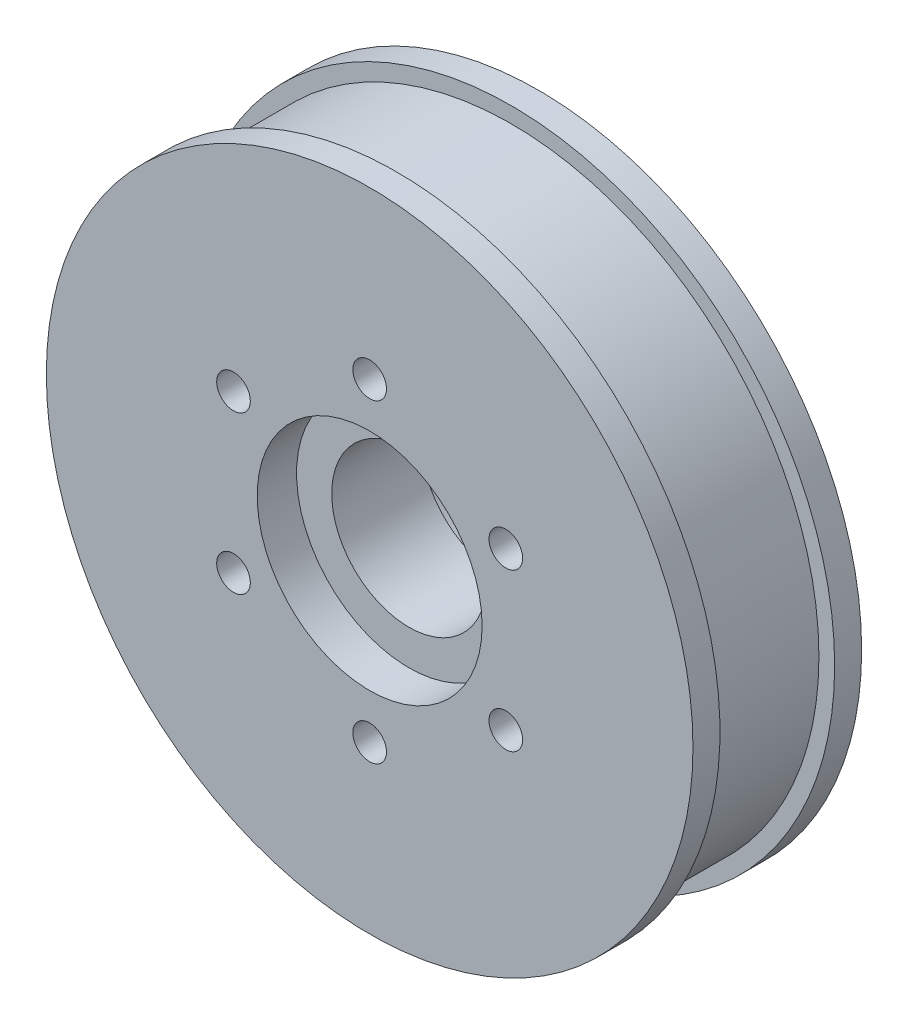
ISO-10303-21;
HEADER;
FILE_DESCRIPTION(('STEP AP214'),'2;1');
FILE_NAME('part.step','',(''),(''),'','','');
FILE_SCHEMA(('AUTOMOTIVE_DESIGN { 1 0 10303 214 1 1 1 1 }'));
ENDSEC;
DATA;
#1=APPLICATION_CONTEXT('core data for automotive mechanical design processes');
#2=APPLICATION_PROTOCOL_DEFINITION('international standard','automotive_design',2000,#1);
#3=PRODUCT_CONTEXT('',#1,'mechanical');
#4=PRODUCT('Part','Part','',(#3));
#5=PRODUCT_RELATED_PRODUCT_CATEGORY('part','',(#4));
#6=PRODUCT_DEFINITION_FORMATION('','',#4);
#7=PRODUCT_DEFINITION_CONTEXT('part definition',#1,'design');
#8=PRODUCT_DEFINITION('design','',#6,#7);
#9=PRODUCT_DEFINITION_SHAPE('','',#8);
#10=(LENGTH_UNIT() NAMED_UNIT(*) SI_UNIT(.MILLI.,.METRE.));
#11=(NAMED_UNIT(*) PLANE_ANGLE_UNIT() SI_UNIT($,.RADIAN.));
#12=(NAMED_UNIT(*) SI_UNIT($,.STERADIAN.) SOLID_ANGLE_UNIT());
#13=UNCERTAINTY_MEASURE_WITH_UNIT(LENGTH_MEASURE(1.E-05),#10,'distance_accuracy_value','');
#14=(GEOMETRIC_REPRESENTATION_CONTEXT(3) GLOBAL_UNCERTAINTY_ASSIGNED_CONTEXT((#13)) GLOBAL_UNIT_ASSIGNED_CONTEXT((#10,
#11,#12)) REPRESENTATION_CONTEXT('',''));
#15=CARTESIAN_POINT('',(0.,0.,0.));
#16=DIRECTION('',(0.,0.,1.));
#17=DIRECTION('',(1.,0.,0.));
#18=AXIS2_PLACEMENT_3D('',#15,#16,#17);
#19=CARTESIAN_POINT('',(0.,0.,19.05));
#20=DIRECTION('',(0.,0.,-1.));
#21=DIRECTION('',(-1.,0.,0.));
#22=AXIS2_PLACEMENT_3D('',#19,#20,#21);
#23=CYLINDRICAL_SURFACE('',#22,36.5125);
#24=CARTESIAN_POINT('',(0.,0.,19.05));
#25=DIRECTION('',(0.,0.,1.));
#26=DIRECTION('',(1.,0.,0.));
#27=AXIS2_PLACEMENT_3D('',#24,#25,#26);
#28=CIRCLE('',#27,36.5125);
#29=CARTESIAN_POINT('',(36.5125,0.,19.05));
#30=VERTEX_POINT('',#29);
#31=EDGE_CURVE('E10',#30,#30,#28,.T.);
#32=ORIENTED_EDGE('',*,*,#31,.F.);
#33=EDGE_LOOP('',(#32));
#34=FACE_BOUND('',#33,.T.);
#35=CARTESIAN_POINT('',(0.,0.,16.002));
#36=DIRECTION('',(0.,0.,-1.));
#37=DIRECTION('',(-1.,0.,0.));
#38=AXIS2_PLACEMENT_3D('',#35,#36,#37);
#39=CIRCLE('',#38,36.5125);
#40=CARTESIAN_POINT('',(-36.5125,0.,16.002));
#41=VERTEX_POINT('',#40);
#42=EDGE_CURVE('E36',#41,#41,#39,.T.);
#43=ORIENTED_EDGE('',*,*,#42,.F.);
#44=EDGE_LOOP('',(#43));
#45=FACE_BOUND('',#44,.T.);
#46=ADVANCED_FACE('F33',(#34,#45),#23,.T.);
#47=CARTESIAN_POINT('',(0.,0.,0.));
#48=DIRECTION('',(0.,0.,1.));
#49=DIRECTION('',(1.,0.,0.));
#50=AXIS2_PLACEMENT_3D('',#47,#48,#49);
#51=CIRCLE('',#50,36.5125);
#52=CARTESIAN_POINT('',(36.5125,0.,0.));
#53=VERTEX_POINT('',#52);
#54=EDGE_CURVE('E40',#53,#53,#51,.T.);
#55=ORIENTED_EDGE('',*,*,#54,.T.);
#56=EDGE_LOOP('',(#55));
#57=FACE_BOUND('',#56,.T.);
#58=CARTESIAN_POINT('',(0.,0.,3.048));
#59=DIRECTION('',(0.,0.,1.));
#60=DIRECTION('',(1.,0.,0.));
#61=AXIS2_PLACEMENT_3D('',#58,#59,#60);
#62=CIRCLE('',#61,36.5125);
#63=CARTESIAN_POINT('',(36.5125,0.,3.048));
#64=VERTEX_POINT('',#63);
#65=EDGE_CURVE('E57',#64,#64,#62,.T.);
#66=ORIENTED_EDGE('',*,*,#65,.F.);
#67=EDGE_LOOP('',(#66));
#68=FACE_BOUND('',#67,.T.);
#69=ADVANCED_FACE('F131',(#57,#68),#23,.T.);
#70=CARTESIAN_POINT('',(0.,0.,0.));
#71=DIRECTION('',(0.,0.,1.));
#72=DIRECTION('',(1.,0.,0.));
#73=AXIS2_PLACEMENT_3D('',#70,#71,#72);
#74=CYLINDRICAL_SURFACE('',#73,8.73125);
#75=CARTESIAN_POINT('',(0.,0.,14.605));
#76=DIRECTION('',(0.,0.,1.));
#77=DIRECTION('',(1.,0.,0.));
#78=AXIS2_PLACEMENT_3D('',#75,#76,#77);
#79=CIRCLE('',#78,8.73125);
#80=CARTESIAN_POINT('',(8.73125,0.,14.605));
#81=VERTEX_POINT('',#80);
#82=EDGE_CURVE('E45',#81,#81,#79,.F.);
#83=ORIENTED_EDGE('',*,*,#82,.F.);
#84=EDGE_LOOP('',(#83));
#85=FACE_BOUND('',#84,.T.);
#86=CARTESIAN_POINT('',(0.,0.,4.445));
#87=DIRECTION('',(0.,0.,-1.));
#88=DIRECTION('',(-1.,0.,0.));
#89=AXIS2_PLACEMENT_3D('',#86,#87,#88);
#90=CIRCLE('',#89,8.73125);
#91=CARTESIAN_POINT('',(-8.73125,0.,4.445));
#92=VERTEX_POINT('',#91);
#93=EDGE_CURVE('E54',#92,#92,#90,.F.);
#94=ORIENTED_EDGE('',*,*,#93,.F.);
#95=EDGE_LOOP('',(#94));
#96=FACE_BOUND('',#95,.T.);
#97=ADVANCED_FACE('F122',(#85,#96),#74,.F.);
#98=CARTESIAN_POINT('',(0.,0.,19.05));
#99=DIRECTION('',(0.,0.,1.));
#100=DIRECTION('',(1.,0.,0.));
#101=AXIS2_PLACEMENT_3D('',#98,#99,#100);
#102=PLANE('',#101);
#103=CARTESIAN_POINT('',(0.,17.7546,19.05));
#104=DIRECTION('',(0.,0.,1.));
#105=DIRECTION('',(1.,0.,0.));
#106=AXIS2_PLACEMENT_3D('',#103,#104,#105);
#107=CIRCLE('',#106,1.89864999999999);
#108=CARTESIAN_POINT('',(1.89865,17.7546,19.05));
#109=VERTEX_POINT('',#108);
#110=EDGE_CURVE('E63',#109,#109,#107,.T.);
#111=ORIENTED_EDGE('',*,*,#110,.F.);
#112=EDGE_LOOP('',(#111));
#113=FACE_BOUND('',#112,.T.);
#114=CARTESIAN_POINT('',(-15.3759346340309,8.87729999999988,19.05));
#115=DIRECTION('',(0.,0.,1.));
#116=DIRECTION('',(1.,0.,0.));
#117=AXIS2_PLACEMENT_3D('',#114,#115,#116);
#118=CIRCLE('',#117,1.89864999999999);
#119=CARTESIAN_POINT('',(-13.4772846340309,8.87729999999988,19.05));
#120=VERTEX_POINT('',#119);
#121=EDGE_CURVE('E77',#120,#120,#118,.T.);
#122=ORIENTED_EDGE('',*,*,#121,.F.);
#123=EDGE_LOOP('',(#122));
#124=FACE_BOUND('',#123,.T.);
#125=CARTESIAN_POINT('',(-15.3759346340307,-8.87730000000014,19.05));
#126=DIRECTION('',(0.,0.,1.));
#127=DIRECTION('',(1.,0.,0.));
#128=AXIS2_PLACEMENT_3D('',#125,#126,#127);
#129=CIRCLE('',#128,1.89864999999999);
#130=CARTESIAN_POINT('',(-13.4772846340307,-8.87730000000014,19.05));
#131=VERTEX_POINT('',#130);
#132=EDGE_CURVE('E83',#131,#131,#129,.T.);
#133=ORIENTED_EDGE('',*,*,#132,.F.);
#134=EDGE_LOOP('',(#133));
#135=FACE_BOUND('',#134,.T.);
#136=CARTESIAN_POINT('',(6.05418493115906E-13,-17.7546,19.05));
#137=DIRECTION('',(0.,0.,1.));
#138=DIRECTION('',(1.,0.,0.));
#139=AXIS2_PLACEMENT_3D('',#136,#137,#138);
#140=CIRCLE('',#139,1.89864999999999);
#141=CARTESIAN_POINT('',(1.89865000000059,-17.7546,19.05));
#142=VERTEX_POINT('',#141);
#143=EDGE_CURVE('E89',#142,#142,#140,.T.);
#144=ORIENTED_EDGE('',*,*,#143,.F.);
#145=EDGE_LOOP('',(#144));
#146=FACE_BOUND('',#145,.T.);
#147=CARTESIAN_POINT('',(15.3759346340317,-8.87729999999973,19.05));
#148=DIRECTION('',(0.,0.,1.));
#149=DIRECTION('',(1.,0.,0.));
#150=AXIS2_PLACEMENT_3D('',#147,#148,#149);
#151=CIRCLE('',#150,1.89864999999999);
#152=CARTESIAN_POINT('',(17.2745846340317,-8.87729999999973,19.05));
#153=VERTEX_POINT('',#152);
#154=EDGE_CURVE('E95',#153,#153,#151,.T.);
#155=ORIENTED_EDGE('',*,*,#154,.F.);
#156=EDGE_LOOP('',(#155));
#157=FACE_BOUND('',#156,.T.);
#158=CARTESIAN_POINT('',(15.3759346340314,8.87730000000029,19.05));
#159=DIRECTION('',(0.,0.,1.));
#160=DIRECTION('',(1.,0.,0.));
#161=AXIS2_PLACEMENT_3D('',#158,#159,#160);
#162=CIRCLE('',#161,1.89864999999999);
#163=CARTESIAN_POINT('',(17.2745846340314,8.87730000000029,19.05));
#164=VERTEX_POINT('',#163);
#165=EDGE_CURVE('E101',#164,#164,#162,.T.);
#166=ORIENTED_EDGE('',*,*,#165,.F.);
#167=EDGE_LOOP('',(#166));
#168=FACE_BOUND('',#167,.T.);
#169=CARTESIAN_POINT('',(0.,0.,19.05));
#170=DIRECTION('',(0.,0.,1.));
#171=DIRECTION('',(1.,0.,0.));
#172=AXIS2_PLACEMENT_3D('',#169,#170,#171);
#173=CIRCLE('',#172,12.7);
#174=CARTESIAN_POINT('',(12.7,0.,19.05));
#175=VERTEX_POINT('',#174);
#176=EDGE_CURVE('E48',#175,#175,#173,.T.);
#177=ORIENTED_EDGE('',*,*,#176,.F.);
#178=EDGE_LOOP('',(#177));
#179=FACE_BOUND('',#178,.T.);
#180=ORIENTED_EDGE('',*,*,#31,.T.);
#181=EDGE_LOOP('',(#180));
#182=FACE_BOUND('',#181,.T.);
#183=ADVANCED_FACE('F119',(#113,#124,#135,#146,#157,#168,#179,#182),#102,.T.);
#184=CARTESIAN_POINT('',(0.,0.,0.));
#185=DIRECTION('',(0.,0.,1.));
#186=DIRECTION('',(1.,0.,0.));
#187=AXIS2_PLACEMENT_3D('',#184,#185,#186);
#188=PLANE('',#187);
#189=CARTESIAN_POINT('',(0.,17.7546,0.));
#190=DIRECTION('',(0.,0.,1.));
#191=DIRECTION('',(1.,0.,0.));
#192=AXIS2_PLACEMENT_3D('',#189,#190,#191);
#193=CIRCLE('',#192,1.89864999999999);
#194=CARTESIAN_POINT('',(1.89865,17.7546,0.));
#195=VERTEX_POINT('',#194);
#196=EDGE_CURVE('E74',#195,#195,#193,.T.);
#197=ORIENTED_EDGE('',*,*,#196,.T.);
#198=EDGE_LOOP('',(#197));
#199=FACE_BOUND('',#198,.T.);
#200=CARTESIAN_POINT('',(-15.3759346340309,8.87729999999988,0.));
#201=DIRECTION('',(0.,0.,1.));
#202=DIRECTION('',(1.,0.,0.));
#203=AXIS2_PLACEMENT_3D('',#200,#201,#202);
#204=CIRCLE('',#203,1.89864999999998);
#205=CARTESIAN_POINT('',(-13.4772846340309,8.87729999999988,0.));
#206=VERTEX_POINT('',#205);
#207=EDGE_CURVE('E80',#206,#206,#204,.T.);
#208=ORIENTED_EDGE('',*,*,#207,.T.);
#209=EDGE_LOOP('',(#208));
#210=FACE_BOUND('',#209,.T.);
#211=CARTESIAN_POINT('',(-15.3759346340307,-8.87730000000014,0.));
#212=DIRECTION('',(0.,0.,1.));
#213=DIRECTION('',(1.,0.,0.));
#214=AXIS2_PLACEMENT_3D('',#211,#212,#213);
#215=CIRCLE('',#214,1.89864999999998);
#216=CARTESIAN_POINT('',(-13.4772846340307,-8.87730000000014,0.));
#217=VERTEX_POINT('',#216);
#218=EDGE_CURVE('E86',#217,#217,#215,.T.);
#219=ORIENTED_EDGE('',*,*,#218,.T.);
#220=EDGE_LOOP('',(#219));
#221=FACE_BOUND('',#220,.T.);
#222=CARTESIAN_POINT('',(6.05418493115906E-13,-17.7546,0.));
#223=DIRECTION('',(0.,0.,1.));
#224=DIRECTION('',(1.,0.,0.));
#225=AXIS2_PLACEMENT_3D('',#222,#223,#224);
#226=CIRCLE('',#225,1.89864999999999);
#227=CARTESIAN_POINT('',(1.89865000000059,-17.7546,0.));
#228=VERTEX_POINT('',#227);
#229=EDGE_CURVE('E92',#228,#228,#226,.T.);
#230=ORIENTED_EDGE('',*,*,#229,.T.);
#231=EDGE_LOOP('',(#230));
#232=FACE_BOUND('',#231,.T.);
#233=CARTESIAN_POINT('',(15.3759346340317,-8.87729999999973,0.));
#234=DIRECTION('',(0.,0.,1.));
#235=DIRECTION('',(1.,0.,0.));
#236=AXIS2_PLACEMENT_3D('',#233,#234,#235);
#237=CIRCLE('',#236,1.89864999999998);
#238=CARTESIAN_POINT('',(17.2745846340317,-8.87729999999973,0.));
#239=VERTEX_POINT('',#238);
#240=EDGE_CURVE('E98',#239,#239,#237,.T.);
#241=ORIENTED_EDGE('',*,*,#240,.T.);
#242=EDGE_LOOP('',(#241));
#243=FACE_BOUND('',#242,.T.);
#244=CARTESIAN_POINT('',(15.3759346340314,8.87730000000029,0.));
#245=DIRECTION('',(0.,0.,1.));
#246=DIRECTION('',(1.,0.,0.));
#247=AXIS2_PLACEMENT_3D('',#244,#245,#246);
#248=CIRCLE('',#247,1.89864999999998);
#249=CARTESIAN_POINT('',(17.2745846340314,8.87730000000029,0.));
#250=VERTEX_POINT('',#249);
#251=EDGE_CURVE('E104',#250,#250,#248,.T.);
#252=ORIENTED_EDGE('',*,*,#251,.T.);
#253=EDGE_LOOP('',(#252));
#254=FACE_BOUND('',#253,.T.);
#255=CARTESIAN_POINT('',(0.,0.,0.));
#256=DIRECTION('',(0.,0.,-1.));
#257=DIRECTION('',(-1.,0.,0.));
#258=AXIS2_PLACEMENT_3D('',#255,#256,#257);
#259=CIRCLE('',#258,12.7);
#260=CARTESIAN_POINT('',(-12.7,0.,0.));
#261=VERTEX_POINT('',#260);
#262=EDGE_CURVE('E107',#261,#261,#259,.T.);
#263=ORIENTED_EDGE('',*,*,#262,.F.);
#264=EDGE_LOOP('',(#263));
#265=FACE_BOUND('',#264,.T.);
#266=ORIENTED_EDGE('',*,*,#54,.F.);
#267=EDGE_LOOP('',(#266));
#268=FACE_BOUND('',#267,.T.);
#269=ADVANCED_FACE('F121',(#199,#210,#221,#232,#243,#254,#265,#268),#188,.F.);
#270=CARTESIAN_POINT('',(0.,0.,14.605));
#271=DIRECTION('',(0.,0.,1.));
#272=DIRECTION('',(1.,0.,0.));
#273=AXIS2_PLACEMENT_3D('',#270,#271,#272);
#274=PLANE('',#273);
#275=CARTESIAN_POINT('',(0.,0.,14.605));
#276=DIRECTION('',(0.,0.,1.));
#277=DIRECTION('',(1.,0.,0.));
#278=AXIS2_PLACEMENT_3D('',#275,#276,#277);
#279=CIRCLE('',#278,12.7);
#280=CARTESIAN_POINT('',(12.7,0.,14.605));
#281=VERTEX_POINT('',#280);
#282=EDGE_CURVE('E53',#281,#281,#279,.T.);
#283=ORIENTED_EDGE('',*,*,#282,.T.);
#284=EDGE_LOOP('',(#283));
#285=FACE_BOUND('',#284,.T.);
#286=ORIENTED_EDGE('',*,*,#82,.T.);
#287=EDGE_LOOP('',(#286));
#288=FACE_BOUND('',#287,.T.);
#289=ADVANCED_FACE('F129',(#285,#288),#274,.T.);
#290=CARTESIAN_POINT('',(0.,0.,14.605));
#291=DIRECTION('',(0.,0.,1.));
#292=DIRECTION('',(1.,0.,0.));
#293=AXIS2_PLACEMENT_3D('',#290,#291,#292);
#294=CYLINDRICAL_SURFACE('',#293,12.7);
#295=ORIENTED_EDGE('',*,*,#282,.F.);
#296=EDGE_LOOP('',(#295));
#297=FACE_BOUND('',#296,.T.);
#298=ORIENTED_EDGE('',*,*,#176,.T.);
#299=EDGE_LOOP('',(#298));
#300=FACE_BOUND('',#299,.T.);
#301=ADVANCED_FACE('F117',(#297,#300),#294,.F.);
#302=CARTESIAN_POINT('',(0.,0.,4.445));
#303=DIRECTION('',(0.,0.,-1.));
#304=DIRECTION('',(-1.,0.,0.));
#305=AXIS2_PLACEMENT_3D('',#302,#303,#304);
#306=PLANE('',#305);
#307=CARTESIAN_POINT('',(0.,0.,4.445));
#308=DIRECTION('',(0.,0.,-1.));
#309=DIRECTION('',(-1.,0.,0.));
#310=AXIS2_PLACEMENT_3D('',#307,#308,#309);
#311=CIRCLE('',#310,12.7);
#312=CARTESIAN_POINT('',(-12.7,0.,4.445));
#313=VERTEX_POINT('',#312);
#314=EDGE_CURVE('E56',#313,#313,#311,.T.);
#315=ORIENTED_EDGE('',*,*,#314,.T.);
#316=EDGE_LOOP('',(#315));
#317=FACE_BOUND('',#316,.T.);
#318=ORIENTED_EDGE('',*,*,#93,.T.);
#319=EDGE_LOOP('',(#318));
#320=FACE_BOUND('',#319,.T.);
#321=ADVANCED_FACE('F182',(#317,#320),#306,.T.);
#322=CARTESIAN_POINT('',(0.,0.,4.445));
#323=DIRECTION('',(0.,0.,-1.));
#324=DIRECTION('',(-1.,0.,0.));
#325=AXIS2_PLACEMENT_3D('',#322,#323,#324);
#326=CYLINDRICAL_SURFACE('',#325,12.7);
#327=ORIENTED_EDGE('',*,*,#314,.F.);
#328=EDGE_LOOP('',(#327));
#329=FACE_BOUND('',#328,.T.);
#330=ORIENTED_EDGE('',*,*,#262,.T.);
#331=EDGE_LOOP('',(#330));
#332=FACE_BOUND('',#331,.T.);
#333=ADVANCED_FACE('F180',(#329,#332),#326,.F.);
#334=CARTESIAN_POINT('',(15.3759346340314,8.87730000000029,19.05));
#335=DIRECTION('',(0.,0.,1.));
#336=DIRECTION('',(1.,0.,0.));
#337=AXIS2_PLACEMENT_3D('',#334,#335,#336);
#338=CYLINDRICAL_SURFACE('',#337,1.89864999999999);
#339=ORIENTED_EDGE('',*,*,#251,.F.);
#340=EDGE_LOOP('',(#339));
#341=FACE_BOUND('',#340,.T.);
#342=ORIENTED_EDGE('',*,*,#165,.T.);
#343=EDGE_LOOP('',(#342));
#344=FACE_BOUND('',#343,.T.);
#345=ADVANCED_FACE('F176',(#341,#344),#338,.F.);
#346=CARTESIAN_POINT('',(15.3759346340317,-8.87729999999973,19.05));
#347=DIRECTION('',(0.,0.,1.));
#348=DIRECTION('',(1.,0.,0.));
#349=AXIS2_PLACEMENT_3D('',#346,#347,#348);
#350=CYLINDRICAL_SURFACE('',#349,1.89864999999999);
#351=ORIENTED_EDGE('',*,*,#240,.F.);
#352=EDGE_LOOP('',(#351));
#353=FACE_BOUND('',#352,.T.);
#354=ORIENTED_EDGE('',*,*,#154,.T.);
#355=EDGE_LOOP('',(#354));
#356=FACE_BOUND('',#355,.T.);
#357=ADVANCED_FACE('F172',(#353,#356),#350,.F.);
#358=CARTESIAN_POINT('',(6.05418493115906E-13,-17.7546,19.05));
#359=DIRECTION('',(0.,0.,1.));
#360=DIRECTION('',(1.,0.,0.));
#361=AXIS2_PLACEMENT_3D('',#358,#359,#360);
#362=CYLINDRICAL_SURFACE('',#361,1.89864999999999);
#363=ORIENTED_EDGE('',*,*,#229,.F.);
#364=EDGE_LOOP('',(#363));
#365=FACE_BOUND('',#364,.T.);
#366=ORIENTED_EDGE('',*,*,#143,.T.);
#367=EDGE_LOOP('',(#366));
#368=FACE_BOUND('',#367,.T.);
#369=ADVANCED_FACE('F168',(#365,#368),#362,.F.);
#370=CARTESIAN_POINT('',(-15.3759346340307,-8.87730000000014,19.05));
#371=DIRECTION('',(0.,0.,1.));
#372=DIRECTION('',(1.,0.,0.));
#373=AXIS2_PLACEMENT_3D('',#370,#371,#372);
#374=CYLINDRICAL_SURFACE('',#373,1.89864999999999);
#375=ORIENTED_EDGE('',*,*,#218,.F.);
#376=EDGE_LOOP('',(#375));
#377=FACE_BOUND('',#376,.T.);
#378=ORIENTED_EDGE('',*,*,#132,.T.);
#379=EDGE_LOOP('',(#378));
#380=FACE_BOUND('',#379,.T.);
#381=ADVANCED_FACE('F164',(#377,#380),#374,.F.);
#382=CARTESIAN_POINT('',(-15.3759346340309,8.87729999999988,19.05));
#383=DIRECTION('',(0.,0.,1.));
#384=DIRECTION('',(1.,0.,0.));
#385=AXIS2_PLACEMENT_3D('',#382,#383,#384);
#386=CYLINDRICAL_SURFACE('',#385,1.89864999999999);
#387=ORIENTED_EDGE('',*,*,#207,.F.);
#388=EDGE_LOOP('',(#387));
#389=FACE_BOUND('',#388,.T.);
#390=ORIENTED_EDGE('',*,*,#121,.T.);
#391=EDGE_LOOP('',(#390));
#392=FACE_BOUND('',#391,.T.);
#393=ADVANCED_FACE('F157',(#389,#392),#386,.F.);
#394=CARTESIAN_POINT('',(0.,17.7546,19.05));
#395=DIRECTION('',(0.,0.,1.));
#396=DIRECTION('',(1.,0.,0.));
#397=AXIS2_PLACEMENT_3D('',#394,#395,#396);
#398=CYLINDRICAL_SURFACE('',#397,1.89864999999999);
#399=ORIENTED_EDGE('',*,*,#196,.F.);
#400=EDGE_LOOP('',(#399));
#401=FACE_BOUND('',#400,.T.);
#402=ORIENTED_EDGE('',*,*,#110,.T.);
#403=EDGE_LOOP('',(#402));
#404=FACE_BOUND('',#403,.T.);
#405=ADVANCED_FACE('F148',(#401,#404),#398,.F.);
#406=CARTESIAN_POINT('',(0.,0.,16.002));
#407=DIRECTION('',(0.,0.,-1.));
#408=DIRECTION('',(-1.,0.,0.));
#409=AXIS2_PLACEMENT_3D('',#406,#407,#408);
#410=PLANE('',#409);
#411=CARTESIAN_POINT('',(0.,0.,16.002));
#412=DIRECTION('',(0.,0.,1.));
#413=DIRECTION('',(1.,0.,0.));
#414=AXIS2_PLACEMENT_3D('',#411,#412,#413);
#415=CIRCLE('',#414,34.7345);
#416=CARTESIAN_POINT('',(34.7345,0.,16.002));
#417=VERTEX_POINT('',#416);
#418=EDGE_CURVE('E59',#417,#417,#415,.T.);
#419=ORIENTED_EDGE('',*,*,#418,.T.);
#420=EDGE_LOOP('',(#419));
#421=FACE_BOUND('',#420,.T.);
#422=ORIENTED_EDGE('',*,*,#42,.T.);
#423=EDGE_LOOP('',(#422));
#424=FACE_BOUND('',#423,.T.);
#425=ADVANCED_FACE('F145',(#421,#424),#410,.T.);
#426=CARTESIAN_POINT('',(0.,0.,3.048));
#427=DIRECTION('',(0.,0.,1.));
#428=DIRECTION('',(1.,0.,0.));
#429=AXIS2_PLACEMENT_3D('',#426,#427,#428);
#430=PLANE('',#429);
#431=CARTESIAN_POINT('',(0.,0.,3.048));
#432=DIRECTION('',(0.,0.,1.));
#433=DIRECTION('',(1.,0.,0.));
#434=AXIS2_PLACEMENT_3D('',#431,#432,#433);
#435=CIRCLE('',#434,34.7345);
#436=CARTESIAN_POINT('',(34.7345,0.,3.048));
#437=VERTEX_POINT('',#436);
#438=EDGE_CURVE('E65',#437,#437,#435,.T.);
#439=ORIENTED_EDGE('',*,*,#438,.F.);
#440=EDGE_LOOP('',(#439));
#441=FACE_BOUND('',#440,.T.);
#442=ORIENTED_EDGE('',*,*,#65,.T.);
#443=EDGE_LOOP('',(#442));
#444=FACE_BOUND('',#443,.T.);
#445=ADVANCED_FACE('F147',(#441,#444),#430,.T.);
#446=CARTESIAN_POINT('',(0.,0.,19.05));
#447=DIRECTION('',(0.,0.,1.));
#448=DIRECTION('',(1.,0.,0.));
#449=AXIS2_PLACEMENT_3D('',#446,#447,#448);
#450=CYLINDRICAL_SURFACE('',#449,34.7345);
#451=ORIENTED_EDGE('',*,*,#438,.T.);
#452=EDGE_LOOP('',(#451));
#453=FACE_BOUND('',#452,.T.);
#454=ORIENTED_EDGE('',*,*,#418,.F.);
#455=EDGE_LOOP('',(#454));
#456=FACE_BOUND('',#455,.T.);
#457=ADVANCED_FACE('F154',(#453,#456),#450,.T.);
#458=CLOSED_SHELL('',(#46,#69,#97,#183,#269,#289,#301,#321,#333,#345,#357,#369,#381,#393,#405,
#425,#445,#457));
#459=MANIFOLD_SOLID_BREP('B2',#458);
#460=ADVANCED_BREP_SHAPE_REPRESENTATION('',(#18,#459),#14);
#461=SHAPE_DEFINITION_REPRESENTATION(#9,#460);
ENDSEC;
END-ISO-10303-21;
